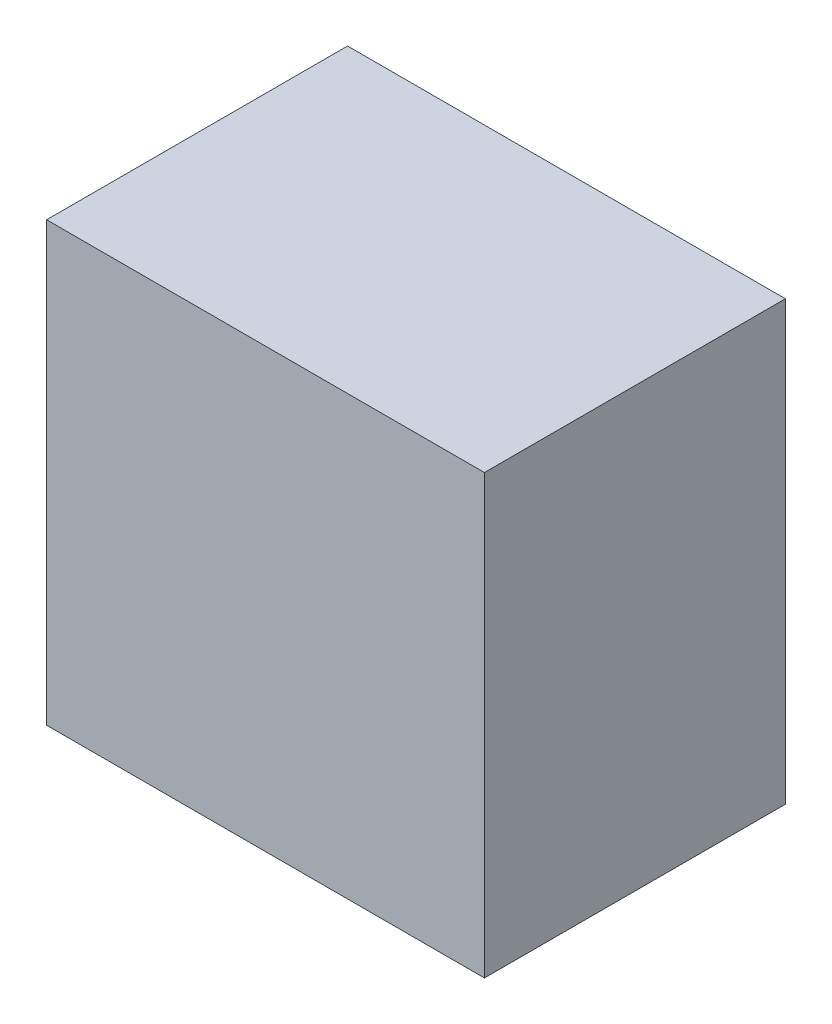
ISO-10303-21;
HEADER;
FILE_DESCRIPTION(('STEP AP214'),'2;1');
FILE_NAME('part.step','',(''),(''),'','','');
FILE_SCHEMA(('AUTOMOTIVE_DESIGN { 1 0 10303 214 1 1 1 1 }'));
ENDSEC;
DATA;
#1=APPLICATION_CONTEXT('core data for automotive mechanical design processes');
#2=APPLICATION_PROTOCOL_DEFINITION('international standard','automotive_design',2000,#1);
#3=PRODUCT_CONTEXT('',#1,'mechanical');
#4=PRODUCT('Part','Part','',(#3));
#5=PRODUCT_RELATED_PRODUCT_CATEGORY('part','',(#4));
#6=PRODUCT_DEFINITION_FORMATION('','',#4);
#7=PRODUCT_DEFINITION_CONTEXT('part definition',#1,'design');
#8=PRODUCT_DEFINITION('design','',#6,#7);
#9=PRODUCT_DEFINITION_SHAPE('','',#8);
#10=(LENGTH_UNIT() NAMED_UNIT(*) SI_UNIT(.MILLI.,.METRE.));
#11=(NAMED_UNIT(*) PLANE_ANGLE_UNIT() SI_UNIT($,.RADIAN.));
#12=(NAMED_UNIT(*) SI_UNIT($,.STERADIAN.) SOLID_ANGLE_UNIT());
#13=UNCERTAINTY_MEASURE_WITH_UNIT(LENGTH_MEASURE(1.E-05),#10,'distance_accuracy_value','');
#14=(GEOMETRIC_REPRESENTATION_CONTEXT(3) GLOBAL_UNCERTAINTY_ASSIGNED_CONTEXT((#13)) GLOBAL_UNIT_ASSIGNED_CONTEXT((#10,
#11,#12)) REPRESENTATION_CONTEXT('',''));
#15=CARTESIAN_POINT('',(0.,0.,0.));
#16=DIRECTION('',(0.,0.,1.));
#17=DIRECTION('',(1.,0.,0.));
#18=AXIS2_PLACEMENT_3D('',#15,#16,#17);
#19=CARTESIAN_POINT('',(0.4000373,-0.3999992,0.5499989));
#20=DIRECTION('',(0.,0.,-1.));
#21=DIRECTION('',(-1.,0.,0.));
#22=AXIS2_PLACEMENT_3D('',#19,#20,#21);
#23=PLANE('',#22);
#24=DIRECTION('',(1.,0.,0.));
#25=VECTOR('',#24,1.);
#26=CARTESIAN_POINT('',(0.4000373,0.3999992,0.5499989));
#27=LINE('',#26,#25);
#28=CARTESIAN_POINT('',(0.4000373,0.3999992,0.5499989));
#29=VERTEX_POINT('',#28);
#30=CARTESIAN_POINT('',(-0.40003476,0.3999992,0.5499989));
#31=VERTEX_POINT('',#30);
#32=EDGE_CURVE('E55',#29,#31,#27,.F.);
#33=ORIENTED_EDGE('',*,*,#32,.T.);
#34=DIRECTION('',(0.,1.,0.));
#35=VECTOR('',#34,1.);
#36=CARTESIAN_POINT('',(-0.40003476,0.3999992,0.5499989));
#37=LINE('',#36,#35);
#38=CARTESIAN_POINT('',(-0.40003476,-0.3999992,0.5499989));
#39=VERTEX_POINT('',#38);
#40=EDGE_CURVE('E57',#31,#39,#37,.F.);
#41=ORIENTED_EDGE('',*,*,#40,.T.);
#42=DIRECTION('',(1.,0.,0.));
#43=VECTOR('',#42,1.);
#44=CARTESIAN_POINT('',(-0.40003476,-0.3999992,0.5499989));
#45=LINE('',#44,#43);
#46=CARTESIAN_POINT('',(0.4000373,-0.3999992,0.5499989));
#47=VERTEX_POINT('',#46);
#48=EDGE_CURVE('E20',#39,#47,#45,.T.);
#49=ORIENTED_EDGE('',*,*,#48,.T.);
#50=DIRECTION('',(0.,1.,0.));
#51=VECTOR('',#50,1.);
#52=CARTESIAN_POINT('',(0.4000373,-0.3999992,0.5499989));
#53=LINE('',#52,#51);
#54=EDGE_CURVE('E80',#47,#29,#53,.T.);
#55=ORIENTED_EDGE('',*,*,#54,.T.);
#56=EDGE_LOOP('',(#33,#41,#49,#55));
#57=FACE_BOUND('',#56,.T.);
#58=ADVANCED_FACE('F17',(#57),#23,.F.);
#59=CARTESIAN_POINT('',(-0.40003476,-0.3999992,0.));
#60=DIRECTION('',(0.,1.,0.));
#61=DIRECTION('',(0.,0.,1.));
#62=AXIS2_PLACEMENT_3D('',#59,#60,#61);
#63=PLANE('',#62);
#64=DIRECTION('',(0.,0.,1.));
#65=VECTOR('',#64,1.);
#66=CARTESIAN_POINT('',(0.4000373,-0.3999992,0.));
#67=LINE('',#66,#65);
#68=CARTESIAN_POINT('',(0.4000373,-0.3999992,0.));
#69=VERTEX_POINT('',#68);
#70=EDGE_CURVE('E68',#69,#47,#67,.T.);
#71=ORIENTED_EDGE('',*,*,#70,.T.);
#72=ORIENTED_EDGE('',*,*,#48,.F.);
#73=DIRECTION('',(0.,0.,-1.));
#74=VECTOR('',#73,1.);
#75=CARTESIAN_POINT('',(-0.40003476,-0.3999992,0.));
#76=LINE('',#75,#74);
#77=CARTESIAN_POINT('',(-0.40003476,-0.3999992,0.));
#78=VERTEX_POINT('',#77);
#79=EDGE_CURVE('E63',#39,#78,#76,.T.);
#80=ORIENTED_EDGE('',*,*,#79,.T.);
#81=DIRECTION('',(-1.,0.,0.));
#82=VECTOR('',#81,1.);
#83=CARTESIAN_POINT('',(0.4000373,-0.3999992,0.));
#84=LINE('',#83,#82);
#85=EDGE_CURVE('E83',#69,#78,#84,.T.);
#86=ORIENTED_EDGE('',*,*,#85,.F.);
#87=EDGE_LOOP('',(#71,#72,#80,#86));
#88=FACE_BOUND('',#87,.T.);
#89=ADVANCED_FACE('F65',(#88),#63,.F.);
#90=CARTESIAN_POINT('',(-0.40003476,0.3999992,0.));
#91=DIRECTION('',(1.,0.,0.));
#92=DIRECTION('',(0.,0.,-1.));
#93=AXIS2_PLACEMENT_3D('',#90,#91,#92);
#94=PLANE('',#93);
#95=ORIENTED_EDGE('',*,*,#79,.F.);
#96=ORIENTED_EDGE('',*,*,#40,.F.);
#97=DIRECTION('',(0.,0.,-1.));
#98=VECTOR('',#97,1.);
#99=CARTESIAN_POINT('',(-0.40003476,0.3999992,0.));
#100=LINE('',#99,#98);
#101=CARTESIAN_POINT('',(-0.40003476,0.3999992,0.));
#102=VERTEX_POINT('',#101);
#103=EDGE_CURVE('E75',#31,#102,#100,.T.);
#104=ORIENTED_EDGE('',*,*,#103,.T.);
#105=DIRECTION('',(0.,1.,0.));
#106=VECTOR('',#105,1.);
#107=CARTESIAN_POINT('',(-0.40003476,-0.3999992,0.));
#108=LINE('',#107,#106);
#109=EDGE_CURVE('E72',#78,#102,#108,.T.);
#110=ORIENTED_EDGE('',*,*,#109,.F.);
#111=EDGE_LOOP('',(#95,#96,#104,#110));
#112=FACE_BOUND('',#111,.T.);
#113=ADVANCED_FACE('F70',(#112),#94,.F.);
#114=CARTESIAN_POINT('',(0.4000373,0.3999992,0.));
#115=DIRECTION('',(0.,-1.,0.));
#116=DIRECTION('',(0.,0.,-1.));
#117=AXIS2_PLACEMENT_3D('',#114,#115,#116);
#118=PLANE('',#117);
#119=ORIENTED_EDGE('',*,*,#103,.F.);
#120=ORIENTED_EDGE('',*,*,#32,.F.);
#121=DIRECTION('',(0.,0.,1.));
#122=VECTOR('',#121,1.);
#123=CARTESIAN_POINT('',(0.4000373,0.3999992,0.));
#124=LINE('',#123,#122);
#125=CARTESIAN_POINT('',(0.4000373,0.3999992,0.));
#126=VERTEX_POINT('',#125);
#127=EDGE_CURVE('E35',#29,#126,#124,.F.);
#128=ORIENTED_EDGE('',*,*,#127,.T.);
#129=DIRECTION('',(-1.,0.,0.));
#130=VECTOR('',#129,1.);
#131=CARTESIAN_POINT('',(0.4000373,0.3999992,0.));
#132=LINE('',#131,#130);
#133=EDGE_CURVE('E26',#102,#126,#132,.F.);
#134=ORIENTED_EDGE('',*,*,#133,.F.);
#135=EDGE_LOOP('',(#119,#120,#128,#134));
#136=FACE_BOUND('',#135,.T.);
#137=ADVANCED_FACE('F89',(#136),#118,.F.);
#138=CARTESIAN_POINT('',(0.4000373,-0.3999992,0.));
#139=DIRECTION('',(-1.,0.,0.));
#140=DIRECTION('',(0.,0.,1.));
#141=AXIS2_PLACEMENT_3D('',#138,#139,#140);
#142=PLANE('',#141);
#143=ORIENTED_EDGE('',*,*,#127,.F.);
#144=ORIENTED_EDGE('',*,*,#54,.F.);
#145=ORIENTED_EDGE('',*,*,#70,.F.);
#146=DIRECTION('',(0.,1.,0.));
#147=VECTOR('',#146,1.);
#148=CARTESIAN_POINT('',(0.4000373,-0.3999992,0.));
#149=LINE('',#148,#147);
#150=EDGE_CURVE('E11',#126,#69,#149,.F.);
#151=ORIENTED_EDGE('',*,*,#150,.F.);
#152=EDGE_LOOP('',(#143,#144,#145,#151));
#153=FACE_BOUND('',#152,.T.);
#154=ADVANCED_FACE('F91',(#153),#142,.F.);
#155=CARTESIAN_POINT('',(0.4000373,-0.3999992,0.));
#156=DIRECTION('',(0.,0.,-1.));
#157=DIRECTION('',(-1.,0.,0.));
#158=AXIS2_PLACEMENT_3D('',#155,#156,#157);
#159=PLANE('',#158);
#160=ORIENTED_EDGE('',*,*,#133,.T.);
#161=ORIENTED_EDGE('',*,*,#150,.T.);
#162=ORIENTED_EDGE('',*,*,#85,.T.);
#163=ORIENTED_EDGE('',*,*,#109,.T.);
#164=EDGE_LOOP('',(#160,#161,#162,#163));
#165=FACE_BOUND('',#164,.T.);
#166=ADVANCED_FACE('F88',(#165),#159,.T.);
#167=CLOSED_SHELL('',(#58,#89,#113,#137,#154,#166));
#168=MANIFOLD_SOLID_BREP('B1',#167);
#169=ADVANCED_BREP_SHAPE_REPRESENTATION('',(#18,#168),#14);
#170=SHAPE_DEFINITION_REPRESENTATION(#9,#169);
ENDSEC;
END-ISO-10303-21;
